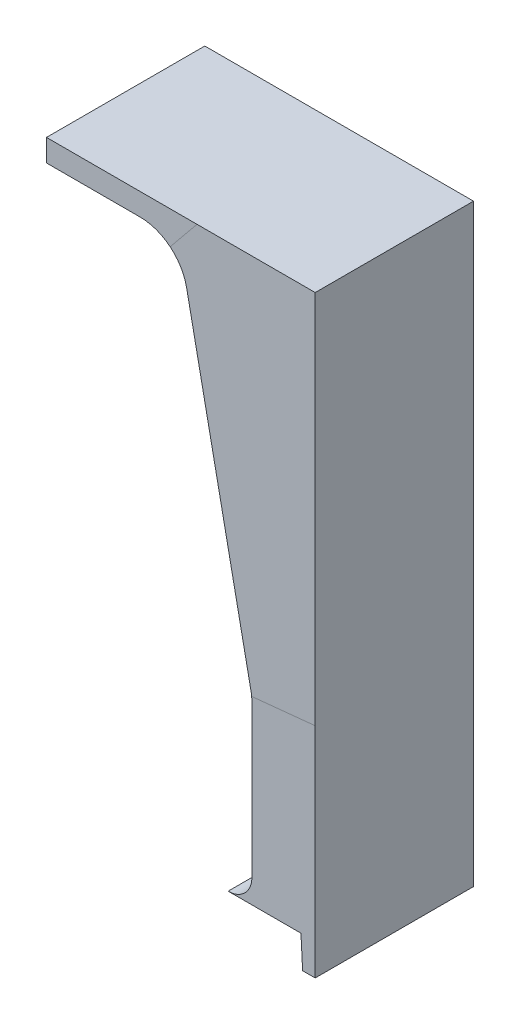
ISO-10303-21;
HEADER;
FILE_DESCRIPTION(('STEP AP214'),'2;1');
FILE_NAME('part.step','',(''),(''),'','','');
FILE_SCHEMA(('AUTOMOTIVE_DESIGN { 1 0 10303 214 1 1 1 1 }'));
ENDSEC;
DATA;
#1=APPLICATION_CONTEXT('core data for automotive mechanical design processes');
#2=APPLICATION_PROTOCOL_DEFINITION('international standard','automotive_design',2000,#1);
#3=PRODUCT_CONTEXT('',#1,'mechanical');
#4=PRODUCT('Part','Part','',(#3));
#5=PRODUCT_RELATED_PRODUCT_CATEGORY('part','',(#4));
#6=PRODUCT_DEFINITION_FORMATION('','',#4);
#7=PRODUCT_DEFINITION_CONTEXT('part definition',#1,'design');
#8=PRODUCT_DEFINITION('design','',#6,#7);
#9=PRODUCT_DEFINITION_SHAPE('','',#8);
#10=(LENGTH_UNIT() NAMED_UNIT(*) SI_UNIT(.MILLI.,.METRE.));
#11=(NAMED_UNIT(*) PLANE_ANGLE_UNIT() SI_UNIT($,.RADIAN.));
#12=(NAMED_UNIT(*) SI_UNIT($,.STERADIAN.) SOLID_ANGLE_UNIT());
#13=UNCERTAINTY_MEASURE_WITH_UNIT(LENGTH_MEASURE(1.E-05),#10,'distance_accuracy_value','');
#14=(GEOMETRIC_REPRESENTATION_CONTEXT(3) GLOBAL_UNCERTAINTY_ASSIGNED_CONTEXT((#13)) GLOBAL_UNIT_ASSIGNED_CONTEXT((#10,
#11,#12)) REPRESENTATION_CONTEXT('',''));
#15=CARTESIAN_POINT('',(0.,0.,0.));
#16=DIRECTION('',(0.,0.,1.));
#17=DIRECTION('',(1.,0.,0.));
#18=AXIS2_PLACEMENT_3D('',#15,#16,#17);
#19=CARTESIAN_POINT('',(0.,5.,0.));
#20=DIRECTION('',(0.,1.,0.));
#21=DIRECTION('',(0.,0.,1.));
#22=AXIS2_PLACEMENT_3D('',#19,#20,#21);
#23=PLANE('',#22);
#24=DIRECTION('',(-1.,0.,0.));
#25=VECTOR('',#24,1.);
#26=CARTESIAN_POINT('',(0.,5.,0.));
#27=LINE('',#26,#25);
#28=CARTESIAN_POINT('',(-0.899999999999999,5.,0.));
#29=VERTEX_POINT('',#28);
#30=CARTESIAN_POINT('',(-5.5,5.,0.));
#31=VERTEX_POINT('',#30);
#32=EDGE_CURVE('E198',#29,#31,#27,.T.);
#33=ORIENTED_EDGE('',*,*,#32,.F.);
#34=DIRECTION('',(0.,0.,1.));
#35=VECTOR('',#34,1.);
#36=CARTESIAN_POINT('',(-0.9,5.,0.));
#37=LINE('',#36,#35);
#38=CARTESIAN_POINT('',(-0.899999999999999,5.,10.));
#39=VERTEX_POINT('',#38);
#40=EDGE_CURVE('E60',#29,#39,#37,.T.);
#41=ORIENTED_EDGE('',*,*,#40,.T.);
#42=DIRECTION('',(1.,0.,0.));
#43=VECTOR('',#42,1.);
#44=CARTESIAN_POINT('',(0.,5.,10.));
#45=LINE('',#44,#43);
#46=CARTESIAN_POINT('',(-5.5,5.,10.));
#47=VERTEX_POINT('',#46);
#48=EDGE_CURVE('E193',#47,#39,#45,.T.);
#49=ORIENTED_EDGE('',*,*,#48,.F.);
#50=DIRECTION('',(0.,0.,1.));
#51=VECTOR('',#50,1.);
#52=CARTESIAN_POINT('',(-5.5,5.,0.));
#53=LINE('',#52,#51);
#54=EDGE_CURVE('E39',#47,#31,#53,.F.);
#55=ORIENTED_EDGE('',*,*,#54,.T.);
#56=EDGE_LOOP('',(#33,#41,#49,#55));
#57=FACE_BOUND('',#56,.T.);
#58=ADVANCED_FACE('F35',(#57),#23,.F.);
#59=CARTESIAN_POINT('',(-5.07676827974426,39.1,0.));
#60=DIRECTION('',(0.,-1.,0.));
#61=DIRECTION('',(0.,0.,-1.));
#62=AXIS2_PLACEMENT_3D('',#59,#60,#61);
#63=PLANE('',#62);
#64=DIRECTION('',(-1.,0.,0.));
#65=VECTOR('',#64,1.);
#66=CARTESIAN_POINT('',(-5.07676827974426,39.1,0.));
#67=LINE('',#66,#65);
#68=CARTESIAN_POINT('',(-11.0616846986896,39.1,0.));
#69=VERTEX_POINT('',#68);
#70=CARTESIAN_POINT('',(-16.9749371855331,39.1,0.));
#71=VERTEX_POINT('',#70);
#72=EDGE_CURVE('E219',#69,#71,#67,.T.);
#73=ORIENTED_EDGE('',*,*,#72,.F.);
#74=DIRECTION('',(0.,0.,-1.));
#75=VECTOR('',#74,1.);
#76=CARTESIAN_POINT('',(-11.0616846986896,39.1,10.));
#77=LINE('',#76,#75);
#78=CARTESIAN_POINT('',(-11.0616846986896,39.1,10.));
#79=VERTEX_POINT('',#78);
#80=EDGE_CURVE('E235',#69,#79,#77,.F.);
#81=ORIENTED_EDGE('',*,*,#80,.T.);
#82=DIRECTION('',(-1.,0.,0.));
#83=VECTOR('',#82,1.);
#84=CARTESIAN_POINT('',(-5.07676827974426,39.1,10.));
#85=LINE('',#84,#83);
#86=CARTESIAN_POINT('',(-16.9749371855331,39.1,10.));
#87=VERTEX_POINT('',#86);
#88=EDGE_CURVE('E226',#79,#87,#85,.T.);
#89=ORIENTED_EDGE('',*,*,#88,.T.);
#90=DIRECTION('',(0.,0.,1.));
#91=VECTOR('',#90,1.);
#92=CARTESIAN_POINT('',(-16.9749371855331,39.1,0.));
#93=LINE('',#92,#91);
#94=EDGE_CURVE('E223',#71,#87,#93,.T.);
#95=ORIENTED_EDGE('',*,*,#94,.F.);
#96=EDGE_LOOP('',(#73,#81,#89,#95));
#97=FACE_BOUND('',#96,.T.);
#98=ADVANCED_FACE('F319',(#97),#63,.T.);
#99=CARTESIAN_POINT('',(-16.9749371855331,43.1,0.));
#100=DIRECTION('',(1.,0.,0.));
#101=DIRECTION('',(0.,0.,-1.));
#102=AXIS2_PLACEMENT_3D('',#99,#100,#101);
#103=PLANE('',#102);
#104=DIRECTION('',(0.,1.,0.));
#105=VECTOR('',#104,1.);
#106=CARTESIAN_POINT('',(-16.9749371855331,43.1,10.));
#107=LINE('',#106,#105);
#108=CARTESIAN_POINT('',(-16.9749371855331,40.5,10.));
#109=VERTEX_POINT('',#108);
#110=EDGE_CURVE('E44',#87,#109,#107,.T.);
#111=ORIENTED_EDGE('',*,*,#110,.T.);
#112=DIRECTION('',(0.,0.,-1.));
#113=VECTOR('',#112,1.);
#114=CARTESIAN_POINT('',(-16.9749371855331,40.5,0.));
#115=LINE('',#114,#113);
#116=CARTESIAN_POINT('',(-16.9749371855331,40.5,0.));
#117=VERTEX_POINT('',#116);
#118=EDGE_CURVE('E169',#109,#117,#115,.T.);
#119=ORIENTED_EDGE('',*,*,#118,.T.);
#120=DIRECTION('',(0.,-1.,0.));
#121=VECTOR('',#120,1.);
#122=CARTESIAN_POINT('',(-16.9749371855331,43.1,0.));
#123=LINE('',#122,#121);
#124=EDGE_CURVE('E12',#117,#71,#123,.T.);
#125=ORIENTED_EDGE('',*,*,#124,.T.);
#126=ORIENTED_EDGE('',*,*,#94,.T.);
#127=EDGE_LOOP('',(#111,#119,#125,#126));
#128=FACE_BOUND('',#127,.T.);
#129=ADVANCED_FACE('F323',(#128),#103,.F.);
#130=CARTESIAN_POINT('',(-5.07676827974426,43.1,0.));
#131=DIRECTION('',(0.,0.,-1.));
#132=DIRECTION('',(-1.,0.,0.));
#133=AXIS2_PLACEMENT_3D('',#130,#131,#132);
#134=PLANE('',#133);
#135=DIRECTION('',(1.,0.,0.));
#136=VECTOR('',#135,1.);
#137=CARTESIAN_POINT('',(-73.,40.5,0.));
#138=LINE('',#137,#136);
#139=CARTESIAN_POINT('',(-7.46534688711194,40.5,0.));
#140=VERTEX_POINT('',#139);
#141=EDGE_CURVE('E154',#117,#140,#138,.T.);
#142=ORIENTED_EDGE('',*,*,#141,.T.);
#143=DIRECTION('',(0.632851685854859,0.77427304209217,0.));
#144=VECTOR('',#143,1.);
#145=CARTESIAN_POINT('',(-16.136072878074,29.8916544109364,0.));
#146=LINE('',#145,#144);
#147=CARTESIAN_POINT('',(-9.16312964112505,38.4228191262765,0.));
#148=VERTEX_POINT('',#147);
#149=EDGE_CURVE('E162',#148,#140,#146,.T.);
#150=ORIENTED_EDGE('',*,*,#149,.F.);
#151=CARTESIAN_POINT('',(-11.0616846986896,36.1,0.));
#152=DIRECTION('',(0.,0.,-1.));
#153=DIRECTION('',(-1.,0.,0.));
#154=AXIS2_PLACEMENT_3D('',#151,#152,#153);
#155=CIRCLE('',#154,3.);
#156=EDGE_CURVE('E239',#148,#69,#155,.F.);
#157=ORIENTED_EDGE('',*,*,#156,.T.);
#158=ORIENTED_EDGE('',*,*,#72,.T.);
#159=ORIENTED_EDGE('',*,*,#124,.F.);
#160=EDGE_LOOP('',(#142,#150,#157,#158,#159));
#161=FACE_BOUND('',#160,.T.);
#162=ADVANCED_FACE('F315',(#161),#134,.T.);
#163=CARTESIAN_POINT('',(-3.89610025125787,15.8873188721875,0.));
#164=DIRECTION('',(-0.98,-0.198997487421325,0.));
#165=DIRECTION('',(0.198997487421325,-0.98,0.));
#166=AXIS2_PLACEMENT_3D('',#163,#164,#165);
#167=PLANE('',#166);
#168=DIRECTION('',(-0.198997487421325,0.98,0.));
#169=VECTOR('',#168,1.);
#170=CARTESIAN_POINT('',(-3.89610025125787,15.8873188721875,0.));
#171=LINE('',#170,#169);
#172=CARTESIAN_POINT('',(-4.06,16.6944735546344,0.));
#173=VERTEX_POINT('',#172);
#174=CARTESIAN_POINT('',(-8.12168469868963,36.696992462264,0.));
#175=VERTEX_POINT('',#174);
#176=EDGE_CURVE('E216',#173,#175,#171,.T.);
#177=ORIENTED_EDGE('',*,*,#176,.F.);
#178=DIRECTION('',(0.,0.,-1.));
#179=VECTOR('',#178,1.);
#180=CARTESIAN_POINT('',(-4.06,16.6944735546344,10.));
#181=LINE('',#180,#179);
#182=CARTESIAN_POINT('',(-4.06,16.6944735546344,10.));
#183=VERTEX_POINT('',#182);
#184=EDGE_CURVE('E250',#173,#183,#181,.F.);
#185=ORIENTED_EDGE('',*,*,#184,.T.);
#186=DIRECTION('',(-0.198997487421325,0.98,0.));
#187=VECTOR('',#186,1.);
#188=CARTESIAN_POINT('',(-3.89610025125787,15.8873188721875,10.));
#189=LINE('',#188,#187);
#190=CARTESIAN_POINT('',(-8.12168469868963,36.696992462264,10.));
#191=VERTEX_POINT('',#190);
#192=EDGE_CURVE('E217',#183,#191,#189,.T.);
#193=ORIENTED_EDGE('',*,*,#192,.T.);
#194=DIRECTION('',(0.,0.,-1.));
#195=VECTOR('',#194,1.);
#196=CARTESIAN_POINT('',(-8.12168469868963,36.696992462264,0.));
#197=LINE('',#196,#195);
#198=EDGE_CURVE('E232',#191,#175,#197,.T.);
#199=ORIENTED_EDGE('',*,*,#198,.T.);
#200=EDGE_LOOP('',(#177,#185,#193,#199));
#201=FACE_BOUND('',#200,.T.);
#202=ADVANCED_FACE('F305',(#201),#167,.T.);
#203=CARTESIAN_POINT('',(-11.0616846986896,36.1,0.));
#204=DIRECTION('',(0.,0.,1.));
#205=DIRECTION('',(1.,0.,0.));
#206=AXIS2_PLACEMENT_3D('',#203,#204,#205);
#207=CYLINDRICAL_SURFACE('',#206,3.);
#208=CARTESIAN_POINT('',(-11.0616846986896,36.1,10.));
#209=DIRECTION('',(0.,0.,1.));
#210=DIRECTION('',(0.,-1.,0.));
#211=AXIS2_PLACEMENT_3D('',#208,#209,#210);
#212=CIRCLE('',#211,3.);
#213=CARTESIAN_POINT('',(-9.16312964112505,38.4228191262765,10.));
#214=VERTEX_POINT('',#213);
#215=EDGE_CURVE('E241',#79,#214,#212,.F.);
#216=ORIENTED_EDGE('',*,*,#215,.F.);
#217=ORIENTED_EDGE('',*,*,#80,.F.);
#218=ORIENTED_EDGE('',*,*,#156,.F.);
#219=CARTESIAN_POINT('',(-11.0616846986896,36.1,0.));
#220=DIRECTION('',(0.,0.,-1.));
#221=DIRECTION('',(-1.,0.,0.));
#222=AXIS2_PLACEMENT_3D('',#219,#220,#221);
#223=CIRCLE('',#222,3.);
#224=EDGE_CURVE('E237',#175,#148,#223,.F.);
#225=ORIENTED_EDGE('',*,*,#224,.F.);
#226=ORIENTED_EDGE('',*,*,#198,.F.);
#227=CARTESIAN_POINT('',(-11.0616846986896,36.1,10.));
#228=DIRECTION('',(0.,0.,1.));
#229=DIRECTION('',(1.,0.,0.));
#230=AXIS2_PLACEMENT_3D('',#227,#228,#229);
#231=CIRCLE('',#230,3.);
#232=EDGE_CURVE('E244',#214,#191,#231,.F.);
#233=ORIENTED_EDGE('',*,*,#232,.F.);
#234=EDGE_LOOP('',(#216,#217,#218,#225,#226,#233));
#235=FACE_BOUND('',#234,.T.);
#236=ADVANCED_FACE('F310',(#235),#207,.F.);
#237=CARTESIAN_POINT('',(-5.07676827974426,43.1,10.));
#238=DIRECTION('',(0.,0.,1.));
#239=DIRECTION('',(0.,-1.,0.));
#240=AXIS2_PLACEMENT_3D('',#237,#238,#239);
#241=PLANE('',#240);
#242=DIRECTION('',(1.,0.,0.));
#243=VECTOR('',#242,1.);
#244=CARTESIAN_POINT('',(-5.07676827974426,40.5,10.));
#245=LINE('',#244,#243);
#246=CARTESIAN_POINT('',(-7.46534688711194,40.5,10.));
#247=VERTEX_POINT('',#246);
#248=EDGE_CURVE('E173',#109,#247,#245,.T.);
#249=ORIENTED_EDGE('',*,*,#248,.F.);
#250=ORIENTED_EDGE('',*,*,#110,.F.);
#251=ORIENTED_EDGE('',*,*,#88,.F.);
#252=ORIENTED_EDGE('',*,*,#215,.T.);
#253=DIRECTION('',(-0.632851685854859,-0.77427304209217,0.));
#254=VECTOR('',#253,1.);
#255=CARTESIAN_POINT('',(-16.136072878074,29.8916544109364,10.));
#256=LINE('',#255,#254);
#257=EDGE_CURVE('E213',#247,#214,#256,.T.);
#258=ORIENTED_EDGE('',*,*,#257,.F.);
#259=EDGE_LOOP('',(#249,#250,#251,#252,#258));
#260=FACE_BOUND('',#259,.T.);
#261=ADVANCED_FACE('F326',(#260),#241,.T.);
#262=CARTESIAN_POINT('',(0.0238997487421334,16.6833088218728,0.));
#263=DIRECTION('',(0.,0.,-1.));
#264=DIRECTION('',(-1.,0.,0.));
#265=AXIS2_PLACEMENT_3D('',#262,#263,#264);
#266=PLANE('',#265);
#267=CARTESIAN_POINT('',(0.,40.5,0.));
#268=VERTEX_POINT('',#267);
#269=EDGE_CURVE('E149',#140,#268,#138,.T.);
#270=ORIENTED_EDGE('',*,*,#269,.T.);
#271=DIRECTION('',(0.,-1.,0.));
#272=VECTOR('',#271,1.);
#273=CARTESIAN_POINT('',(0.,16.8010075630518,0.));
#274=LINE('',#273,#272);
#275=CARTESIAN_POINT('',(0.,16.8010075630518,0.));
#276=VERTEX_POINT('',#275);
#277=EDGE_CURVE('E159',#268,#276,#274,.T.);
#278=ORIENTED_EDGE('',*,*,#277,.T.);
#279=DIRECTION('',(0.99498743710662,0.1,0.));
#280=VECTOR('',#279,1.);
#281=CARTESIAN_POINT('',(-1.17418542704368,16.6829974874213,0.));
#282=LINE('',#281,#280);
#283=CARTESIAN_POINT('',(-4.01503768868014,16.3974810923704,0.));
#284=VERTEX_POINT('',#283);
#285=EDGE_CURVE('E206',#284,#276,#282,.T.);
#286=ORIENTED_EDGE('',*,*,#285,.F.);
#287=CARTESIAN_POINT('',(-7.,16.0974810923704,0.));
#288=DIRECTION('',(0.,0.,-1.));
#289=DIRECTION('',(-1.,0.,0.));
#290=AXIS2_PLACEMENT_3D('',#287,#288,#289);
#291=CIRCLE('',#290,3.);
#292=EDGE_CURVE('E255',#284,#173,#291,.F.);
#293=ORIENTED_EDGE('',*,*,#292,.T.);
#294=ORIENTED_EDGE('',*,*,#176,.T.);
#295=ORIENTED_EDGE('',*,*,#224,.T.);
#296=ORIENTED_EDGE('',*,*,#149,.T.);
#297=EDGE_LOOP('',(#270,#278,#286,#293,#294,#295,#296));
#298=FACE_BOUND('',#297,.T.);
#299=ADVANCED_FACE('F158',(#298),#266,.T.);
#300=CARTESIAN_POINT('',(-7.,16.0974810923704,0.));
#301=DIRECTION('',(0.,0.,1.));
#302=DIRECTION('',(1.,0.,0.));
#303=AXIS2_PLACEMENT_3D('',#300,#301,#302);
#304=CYLINDRICAL_SURFACE('',#303,3.);
#305=CARTESIAN_POINT('',(-7.,16.0974810923704,10.));
#306=DIRECTION('',(0.,0.,1.));
#307=DIRECTION('',(1.,0.,0.));
#308=AXIS2_PLACEMENT_3D('',#305,#306,#307);
#309=CIRCLE('',#308,3.);
#310=CARTESIAN_POINT('',(-4.01503768868014,16.3974810923704,10.));
#311=VERTEX_POINT('',#310);
#312=EDGE_CURVE('E257',#183,#311,#309,.F.);
#313=ORIENTED_EDGE('',*,*,#312,.F.);
#314=ORIENTED_EDGE('',*,*,#184,.F.);
#315=ORIENTED_EDGE('',*,*,#292,.F.);
#316=CARTESIAN_POINT('',(-7.,16.0974810923704,0.));
#317=DIRECTION('',(0.,0.,1.));
#318=DIRECTION('',(1.,0.,0.));
#319=AXIS2_PLACEMENT_3D('',#316,#317,#318);
#320=CIRCLE('',#319,3.);
#321=CARTESIAN_POINT('',(-4.,16.0974810923704,0.));
#322=VERTEX_POINT('',#321);
#323=EDGE_CURVE('E252',#322,#284,#320,.T.);
#324=ORIENTED_EDGE('',*,*,#323,.F.);
#325=DIRECTION('',(0.,0.,-1.));
#326=VECTOR('',#325,1.);
#327=CARTESIAN_POINT('',(-4.,16.0974810923704,0.));
#328=LINE('',#327,#326);
#329=CARTESIAN_POINT('',(-4.,16.0974810923704,10.));
#330=VERTEX_POINT('',#329);
#331=EDGE_CURVE('E247',#330,#322,#328,.T.);
#332=ORIENTED_EDGE('',*,*,#331,.F.);
#333=CARTESIAN_POINT('',(-7.,16.0974810923704,10.));
#334=DIRECTION('',(0.,0.,-1.));
#335=DIRECTION('',(-1.,0.,0.));
#336=AXIS2_PLACEMENT_3D('',#333,#334,#335);
#337=CIRCLE('',#336,3.);
#338=EDGE_CURVE('E260',#311,#330,#337,.T.);
#339=ORIENTED_EDGE('',*,*,#338,.F.);
#340=EDGE_LOOP('',(#313,#314,#315,#324,#332,#339));
#341=FACE_BOUND('',#340,.T.);
#342=ADVANCED_FACE('F300',(#341),#304,.F.);
#343=CARTESIAN_POINT('',(0.0238997487421334,16.6833088218728,10.));
#344=DIRECTION('',(0.,0.,1.));
#345=DIRECTION('',(1.,0.,0.));
#346=AXIS2_PLACEMENT_3D('',#343,#344,#345);
#347=PLANE('',#346);
#348=DIRECTION('',(1.,0.,0.));
#349=VECTOR('',#348,1.);
#350=CARTESIAN_POINT('',(0.0238997487421334,40.5,10.));
#351=LINE('',#350,#349);
#352=CARTESIAN_POINT('',(0.,40.5,10.));
#353=VERTEX_POINT('',#352);
#354=EDGE_CURVE('E52',#247,#353,#351,.T.);
#355=ORIENTED_EDGE('',*,*,#354,.F.);
#356=ORIENTED_EDGE('',*,*,#257,.T.);
#357=ORIENTED_EDGE('',*,*,#232,.T.);
#358=ORIENTED_EDGE('',*,*,#192,.F.);
#359=ORIENTED_EDGE('',*,*,#312,.T.);
#360=DIRECTION('',(-0.99498743710662,-0.1,0.));
#361=VECTOR('',#360,1.);
#362=CARTESIAN_POINT('',(-1.17418542704368,16.6829974874213,10.));
#363=LINE('',#362,#361);
#364=CARTESIAN_POINT('',(0.,16.8010075630518,10.));
#365=VERTEX_POINT('',#364);
#366=EDGE_CURVE('E204',#365,#311,#363,.T.);
#367=ORIENTED_EDGE('',*,*,#366,.F.);
#368=DIRECTION('',(0.,-1.,0.));
#369=VECTOR('',#368,1.);
#370=CARTESIAN_POINT('',(0.,16.8010075630518,10.));
#371=LINE('',#370,#369);
#372=EDGE_CURVE('E168',#353,#365,#371,.T.);
#373=ORIENTED_EDGE('',*,*,#372,.F.);
#374=EDGE_LOOP('',(#355,#356,#357,#358,#359,#367,#373));
#375=FACE_BOUND('',#374,.T.);
#376=ADVANCED_FACE('F294',(#375),#347,.T.);
#377=CARTESIAN_POINT('',(0.,5.,0.));
#378=DIRECTION('',(-1.,0.,0.));
#379=DIRECTION('',(0.,0.,1.));
#380=AXIS2_PLACEMENT_3D('',#377,#378,#379);
#381=PLANE('',#380);
#382=ORIENTED_EDGE('',*,*,#277,.F.);
#383=DIRECTION('',(0.,0.,1.));
#384=VECTOR('',#383,1.);
#385=CARTESIAN_POINT('',(0.,40.5,0.));
#386=LINE('',#385,#384);
#387=EDGE_CURVE('E146',#268,#353,#386,.T.);
#388=ORIENTED_EDGE('',*,*,#387,.T.);
#389=ORIENTED_EDGE('',*,*,#372,.T.);
#390=DIRECTION('',(0.,-1.,0.));
#391=VECTOR('',#390,1.);
#392=CARTESIAN_POINT('',(0.,5.,10.));
#393=LINE('',#392,#391);
#394=CARTESIAN_POINT('',(0.,3.,10.));
#395=VERTEX_POINT('',#394);
#396=EDGE_CURVE('E207',#365,#395,#393,.T.);
#397=ORIENTED_EDGE('',*,*,#396,.T.);
#398=DIRECTION('',(0.,0.,-1.));
#399=VECTOR('',#398,1.);
#400=CARTESIAN_POINT('',(0.,3.,0.));
#401=LINE('',#400,#399);
#402=CARTESIAN_POINT('',(0.,3.,0.));
#403=VERTEX_POINT('',#402);
#404=EDGE_CURVE('E180',#395,#403,#401,.T.);
#405=ORIENTED_EDGE('',*,*,#404,.T.);
#406=DIRECTION('',(0.,-1.,0.));
#407=VECTOR('',#406,1.);
#408=CARTESIAN_POINT('',(0.,5.,0.));
#409=LINE('',#408,#407);
#410=EDGE_CURVE('E166',#276,#403,#409,.T.);
#411=ORIENTED_EDGE('',*,*,#410,.F.);
#412=EDGE_LOOP('',(#382,#388,#389,#397,#405,#411));
#413=FACE_BOUND('',#412,.T.);
#414=ADVANCED_FACE('F164',(#413),#381,.F.);
#415=CARTESIAN_POINT('',(-4.,5.,0.));
#416=DIRECTION('',(-1.,0.,0.));
#417=DIRECTION('',(0.,0.,1.));
#418=AXIS2_PLACEMENT_3D('',#415,#416,#417);
#419=PLANE('',#418);
#420=DIRECTION('',(0.,1.,0.));
#421=VECTOR('',#420,1.);
#422=CARTESIAN_POINT('',(-4.,5.,0.));
#423=LINE('',#422,#421);
#424=CARTESIAN_POINT('',(-4.,6.5,0.));
#425=VERTEX_POINT('',#424);
#426=EDGE_CURVE('E211',#425,#322,#423,.T.);
#427=ORIENTED_EDGE('',*,*,#426,.F.);
#428=DIRECTION('',(0.,0.,1.));
#429=VECTOR('',#428,1.);
#430=CARTESIAN_POINT('',(-4.,6.5,0.));
#431=LINE('',#430,#429);
#432=CARTESIAN_POINT('',(-4.,6.5,10.));
#433=VERTEX_POINT('',#432);
#434=EDGE_CURVE('E263',#425,#433,#431,.T.);
#435=ORIENTED_EDGE('',*,*,#434,.T.);
#436=DIRECTION('',(0.,1.,0.));
#437=VECTOR('',#436,1.);
#438=CARTESIAN_POINT('',(-4.,5.,10.));
#439=LINE('',#438,#437);
#440=EDGE_CURVE('E209',#433,#330,#439,.T.);
#441=ORIENTED_EDGE('',*,*,#440,.T.);
#442=ORIENTED_EDGE('',*,*,#331,.T.);
#443=EDGE_LOOP('',(#427,#435,#441,#442));
#444=FACE_BOUND('',#443,.T.);
#445=ADVANCED_FACE('F279',(#444),#419,.T.);
#446=CARTESIAN_POINT('',(0.,5.,10.));
#447=DIRECTION('',(0.,0.,-1.));
#448=DIRECTION('',(-1.,0.,0.));
#449=AXIS2_PLACEMENT_3D('',#446,#447,#448);
#450=PLANE('',#449);
#451=CARTESIAN_POINT('',(-5.5,6.5,10.));
#452=DIRECTION('',(0.,0.,-1.));
#453=DIRECTION('',(-1.,0.,0.));
#454=AXIS2_PLACEMENT_3D('',#451,#452,#453);
#455=CIRCLE('',#454,1.5);
#456=EDGE_CURVE('E265',#433,#47,#455,.T.);
#457=ORIENTED_EDGE('',*,*,#456,.T.);
#458=ORIENTED_EDGE('',*,*,#48,.T.);
#459=DIRECTION('',(-0.0523359562429438,0.998629534754574,0.));
#460=VECTOR('',#459,1.);
#461=CARTESIAN_POINT('',(-0.899999999999999,5.,10.));
#462=LINE('',#461,#460);
#463=CARTESIAN_POINT('',(-0.795184441433916,3.,10.));
#464=VERTEX_POINT('',#463);
#465=EDGE_CURVE('E187',#464,#39,#462,.T.);
#466=ORIENTED_EDGE('',*,*,#465,.F.);
#467=DIRECTION('',(1.,0.,0.));
#468=VECTOR('',#467,1.);
#469=CARTESIAN_POINT('',(0.,3.,10.));
#470=LINE('',#469,#468);
#471=EDGE_CURVE('E182',#464,#395,#470,.T.);
#472=ORIENTED_EDGE('',*,*,#471,.T.);
#473=ORIENTED_EDGE('',*,*,#396,.F.);
#474=ORIENTED_EDGE('',*,*,#366,.T.);
#475=ORIENTED_EDGE('',*,*,#338,.T.);
#476=ORIENTED_EDGE('',*,*,#440,.F.);
#477=EDGE_LOOP('',(#457,#458,#466,#472,#473,#474,#475,#476));
#478=FACE_BOUND('',#477,.T.);
#479=ADVANCED_FACE('F283',(#478),#450,.F.);
#480=CARTESIAN_POINT('',(0.,5.,0.));
#481=DIRECTION('',(0.,0.,1.));
#482=DIRECTION('',(1.,0.,0.));
#483=AXIS2_PLACEMENT_3D('',#480,#481,#482);
#484=PLANE('',#483);
#485=ORIENTED_EDGE('',*,*,#410,.T.);
#486=DIRECTION('',(-1.,0.,0.));
#487=VECTOR('',#486,1.);
#488=CARTESIAN_POINT('',(0.,3.,0.));
#489=LINE('',#488,#487);
#490=CARTESIAN_POINT('',(-0.795184441433918,3.,0.));
#491=VERTEX_POINT('',#490);
#492=EDGE_CURVE('E177',#403,#491,#489,.T.);
#493=ORIENTED_EDGE('',*,*,#492,.T.);
#494=DIRECTION('',(-0.0523359562429438,0.998629534754574,0.));
#495=VECTOR('',#494,1.);
#496=CARTESIAN_POINT('',(-0.79300638964807,2.95844029616128,0.));
#497=LINE('',#496,#495);
#498=EDGE_CURVE('E189',#491,#29,#497,.T.);
#499=ORIENTED_EDGE('',*,*,#498,.T.);
#500=ORIENTED_EDGE('',*,*,#32,.T.);
#501=CARTESIAN_POINT('',(-5.5,6.5,0.));
#502=DIRECTION('',(0.,0.,1.));
#503=DIRECTION('',(1.,0.,0.));
#504=AXIS2_PLACEMENT_3D('',#501,#502,#503);
#505=CIRCLE('',#504,1.5);
#506=EDGE_CURVE('E197',#31,#425,#505,.T.);
#507=ORIENTED_EDGE('',*,*,#506,.T.);
#508=ORIENTED_EDGE('',*,*,#426,.T.);
#509=ORIENTED_EDGE('',*,*,#323,.T.);
#510=ORIENTED_EDGE('',*,*,#285,.T.);
#511=EDGE_LOOP('',(#485,#493,#499,#500,#507,#508,#509,#510));
#512=FACE_BOUND('',#511,.T.);
#513=ADVANCED_FACE('F37',(#512),#484,.F.);
#514=CARTESIAN_POINT('',(-5.5,6.5,0.));
#515=DIRECTION('',(0.,0.,1.));
#516=DIRECTION('',(1.,0.,0.));
#517=AXIS2_PLACEMENT_3D('',#514,#515,#516);
#518=CYLINDRICAL_SURFACE('',#517,1.5);
#519=ORIENTED_EDGE('',*,*,#506,.F.);
#520=ORIENTED_EDGE('',*,*,#54,.F.);
#521=ORIENTED_EDGE('',*,*,#456,.F.);
#522=ORIENTED_EDGE('',*,*,#434,.F.);
#523=EDGE_LOOP('',(#519,#520,#521,#522));
#524=FACE_BOUND('',#523,.T.);
#525=ADVANCED_FACE('F281',(#524),#518,.F.);
#526=CARTESIAN_POINT('',(-0.9,5.,0.));
#527=DIRECTION('',(-0.998629534754574,-0.0523359562429438,0.));
#528=DIRECTION('',(0.0523359562429438,-0.998629534754574,0.));
#529=AXIS2_PLACEMENT_3D('',#526,#527,#528);
#530=PLANE('',#529);
#531=ORIENTED_EDGE('',*,*,#40,.F.);
#532=ORIENTED_EDGE('',*,*,#498,.F.);
#533=DIRECTION('',(0.,0.,1.));
#534=VECTOR('',#533,1.);
#535=CARTESIAN_POINT('',(-0.795184441433918,3.,0.));
#536=LINE('',#535,#534);
#537=EDGE_CURVE('E185',#491,#464,#536,.T.);
#538=ORIENTED_EDGE('',*,*,#537,.T.);
#539=ORIENTED_EDGE('',*,*,#465,.T.);
#540=EDGE_LOOP('',(#531,#532,#538,#539));
#541=FACE_BOUND('',#540,.T.);
#542=ADVANCED_FACE('F291',(#541),#530,.T.);
#543=CARTESIAN_POINT('',(0.,3.,0.));
#544=DIRECTION('',(0.,1.,0.));
#545=DIRECTION('',(0.,0.,1.));
#546=AXIS2_PLACEMENT_3D('',#543,#544,#545);
#547=PLANE('',#546);
#548=ORIENTED_EDGE('',*,*,#537,.F.);
#549=ORIENTED_EDGE('',*,*,#492,.F.);
#550=ORIENTED_EDGE('',*,*,#404,.F.);
#551=ORIENTED_EDGE('',*,*,#471,.F.);
#552=EDGE_LOOP('',(#548,#549,#550,#551));
#553=FACE_BOUND('',#552,.T.);
#554=ADVANCED_FACE('F289',(#553),#547,.F.);
#555=CARTESIAN_POINT('',(-73.,40.5,0.));
#556=DIRECTION('',(0.,-1.,0.));
#557=DIRECTION('',(0.,0.,-1.));
#558=AXIS2_PLACEMENT_3D('',#555,#556,#557);
#559=PLANE('',#558);
#560=ORIENTED_EDGE('',*,*,#248,.T.);
#561=ORIENTED_EDGE('',*,*,#354,.T.);
#562=ORIENTED_EDGE('',*,*,#387,.F.);
#563=ORIENTED_EDGE('',*,*,#269,.F.);
#564=ORIENTED_EDGE('',*,*,#141,.F.);
#565=ORIENTED_EDGE('',*,*,#118,.F.);
#566=EDGE_LOOP('',(#560,#561,#562,#563,#564,#565));
#567=FACE_BOUND('',#566,.T.);
#568=ADVANCED_FACE('F148',(#567),#559,.F.);
#569=CLOSED_SHELL('',(#58,#98,#129,#162,#202,#236,#261,#299,#342,#376,#414,#445,#479,#513,#525,
#542,#554,#568));
#570=MANIFOLD_SOLID_BREP('B2',#569);
#571=ADVANCED_BREP_SHAPE_REPRESENTATION('',(#18,#570),#14);
#572=SHAPE_DEFINITION_REPRESENTATION(#9,#571);
ENDSEC;
END-ISO-10303-21;
